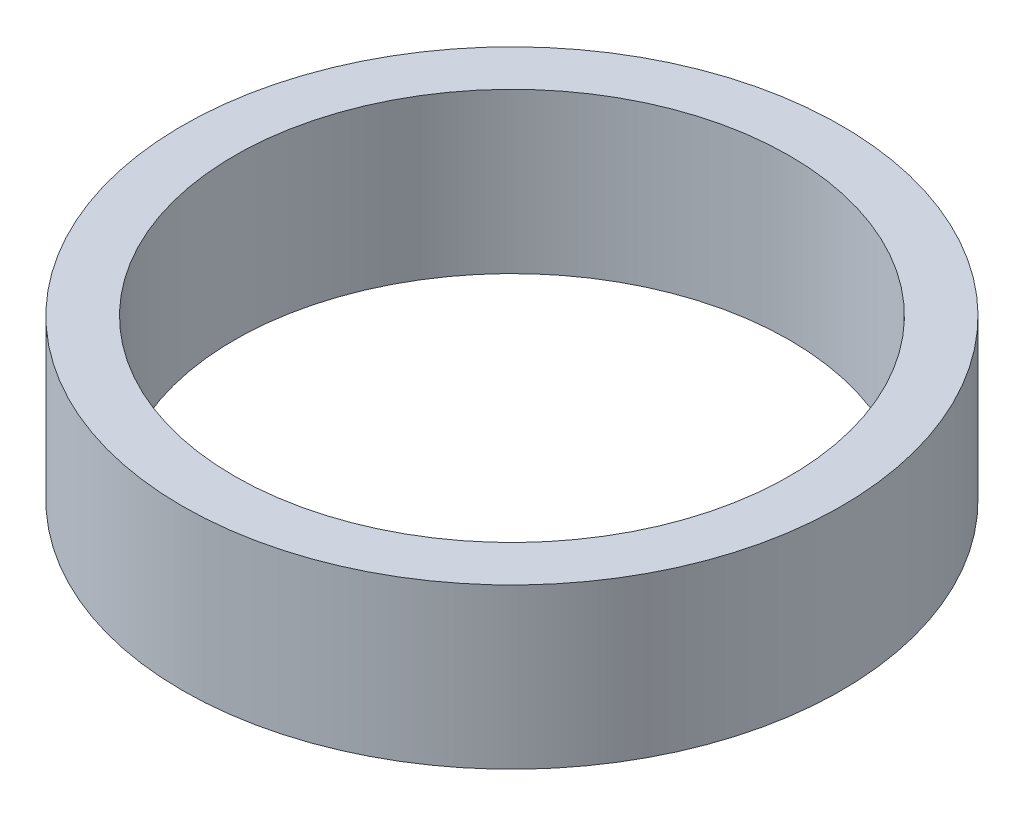
ISO-10303-21;
HEADER;
FILE_DESCRIPTION(('STEP AP214'),'2;1');
FILE_NAME('part.step','',(''),(''),'','','');
FILE_SCHEMA(('AUTOMOTIVE_DESIGN { 1 0 10303 214 1 1 1 1 }'));
ENDSEC;
DATA;
#1=APPLICATION_CONTEXT('core data for automotive mechanical design processes');
#2=APPLICATION_PROTOCOL_DEFINITION('international standard','automotive_design',2000,#1);
#3=PRODUCT_CONTEXT('',#1,'mechanical');
#4=PRODUCT('Part','Part','',(#3));
#5=PRODUCT_RELATED_PRODUCT_CATEGORY('part','',(#4));
#6=PRODUCT_DEFINITION_FORMATION('','',#4);
#7=PRODUCT_DEFINITION_CONTEXT('part definition',#1,'design');
#8=PRODUCT_DEFINITION('design','',#6,#7);
#9=PRODUCT_DEFINITION_SHAPE('','',#8);
#10=(LENGTH_UNIT() NAMED_UNIT(*) SI_UNIT(.MILLI.,.METRE.));
#11=(NAMED_UNIT(*) PLANE_ANGLE_UNIT() SI_UNIT($,.RADIAN.));
#12=(NAMED_UNIT(*) SI_UNIT($,.STERADIAN.) SOLID_ANGLE_UNIT());
#13=UNCERTAINTY_MEASURE_WITH_UNIT(LENGTH_MEASURE(1.E-05),#10,'distance_accuracy_value','');
#14=(GEOMETRIC_REPRESENTATION_CONTEXT(3) GLOBAL_UNCERTAINTY_ASSIGNED_CONTEXT((#13)) GLOBAL_UNIT_ASSIGNED_CONTEXT((#10,
#11,#12)) REPRESENTATION_CONTEXT('',''));
#15=CARTESIAN_POINT('',(0.,0.,0.));
#16=DIRECTION('',(0.,0.,1.));
#17=DIRECTION('',(1.,0.,0.));
#18=AXIS2_PLACEMENT_3D('',#15,#16,#17);
#19=CARTESIAN_POINT('',(0.,23.,0.));
#20=DIRECTION('',(0.,-1.,0.));
#21=DIRECTION('',(0.,0.,-1.));
#22=AXIS2_PLACEMENT_3D('',#19,#20,#21);
#23=CYLINDRICAL_SURFACE('',#22,47.5);
#24=CARTESIAN_POINT('',(0.,23.,0.));
#25=DIRECTION('',(0.,1.,0.));
#26=DIRECTION('',(0.,0.,1.));
#27=AXIS2_PLACEMENT_3D('',#24,#25,#26);
#28=CIRCLE('',#27,47.5);
#29=CARTESIAN_POINT('',(0.,23.,47.5));
#30=VERTEX_POINT('',#29);
#31=EDGE_CURVE('E10',#30,#30,#28,.T.);
#32=ORIENTED_EDGE('',*,*,#31,.F.);
#33=EDGE_LOOP('',(#32));
#34=FACE_BOUND('',#33,.T.);
#35=CARTESIAN_POINT('',(0.,0.,0.));
#36=DIRECTION('',(0.,1.,0.));
#37=DIRECTION('',(0.,0.,1.));
#38=AXIS2_PLACEMENT_3D('',#35,#36,#37);
#39=CIRCLE('',#38,47.5);
#40=CARTESIAN_POINT('',(0.,0.,47.5));
#41=VERTEX_POINT('',#40);
#42=EDGE_CURVE('E37',#41,#41,#39,.T.);
#43=ORIENTED_EDGE('',*,*,#42,.T.);
#44=EDGE_LOOP('',(#43));
#45=FACE_BOUND('',#44,.T.);
#46=ADVANCED_FACE('F40',(#34,#45),#23,.T.);
#47=CARTESIAN_POINT('',(0.,23.,0.));
#48=DIRECTION('',(0.,1.,0.));
#49=DIRECTION('',(0.,0.,1.));
#50=AXIS2_PLACEMENT_3D('',#47,#48,#49);
#51=PLANE('',#50);
#52=CARTESIAN_POINT('',(0.,23.,0.));
#53=DIRECTION('',(0.,1.,0.));
#54=DIRECTION('',(0.,0.,1.));
#55=AXIS2_PLACEMENT_3D('',#52,#53,#54);
#56=CIRCLE('',#55,40.);
#57=CARTESIAN_POINT('',(0.,23.,40.));
#58=VERTEX_POINT('',#57);
#59=EDGE_CURVE('E50',#58,#58,#56,.T.);
#60=ORIENTED_EDGE('',*,*,#59,.F.);
#61=EDGE_LOOP('',(#60));
#62=FACE_BOUND('',#61,.T.);
#63=ORIENTED_EDGE('',*,*,#31,.T.);
#64=EDGE_LOOP('',(#63));
#65=FACE_BOUND('',#64,.T.);
#66=ADVANCED_FACE('F59',(#62,#65),#51,.T.);
#67=CARTESIAN_POINT('',(0.,0.,0.));
#68=DIRECTION('',(0.,1.,0.));
#69=DIRECTION('',(0.,0.,1.));
#70=AXIS2_PLACEMENT_3D('',#67,#68,#69);
#71=PLANE('',#70);
#72=CARTESIAN_POINT('',(0.,0.,0.));
#73=DIRECTION('',(0.,1.,0.));
#74=DIRECTION('',(0.,0.,1.));
#75=AXIS2_PLACEMENT_3D('',#72,#73,#74);
#76=CIRCLE('',#75,40.);
#77=CARTESIAN_POINT('',(0.,0.,40.));
#78=VERTEX_POINT('',#77);
#79=EDGE_CURVE('E47',#78,#78,#76,.T.);
#80=ORIENTED_EDGE('',*,*,#79,.T.);
#81=EDGE_LOOP('',(#80));
#82=FACE_BOUND('',#81,.T.);
#83=ORIENTED_EDGE('',*,*,#42,.F.);
#84=EDGE_LOOP('',(#83));
#85=FACE_BOUND('',#84,.T.);
#86=ADVANCED_FACE('F58',(#82,#85),#71,.F.);
#87=CARTESIAN_POINT('',(0.,23.,0.));
#88=DIRECTION('',(0.,-1.,0.));
#89=DIRECTION('',(0.,0.,-1.));
#90=AXIS2_PLACEMENT_3D('',#87,#88,#89);
#91=CYLINDRICAL_SURFACE('',#90,40.);
#92=ORIENTED_EDGE('',*,*,#59,.T.);
#93=EDGE_LOOP('',(#92));
#94=FACE_BOUND('',#93,.T.);
#95=ORIENTED_EDGE('',*,*,#79,.F.);
#96=EDGE_LOOP('',(#95));
#97=FACE_BOUND('',#96,.T.);
#98=ADVANCED_FACE('F54',(#94,#97),#91,.F.);
#99=CLOSED_SHELL('',(#46,#66,#86,#98));
#100=MANIFOLD_SOLID_BREP('B2',#99);
#101=ADVANCED_BREP_SHAPE_REPRESENTATION('',(#18,#100),#14);
#102=SHAPE_DEFINITION_REPRESENTATION(#9,#101);
ENDSEC;
END-ISO-10303-21;
